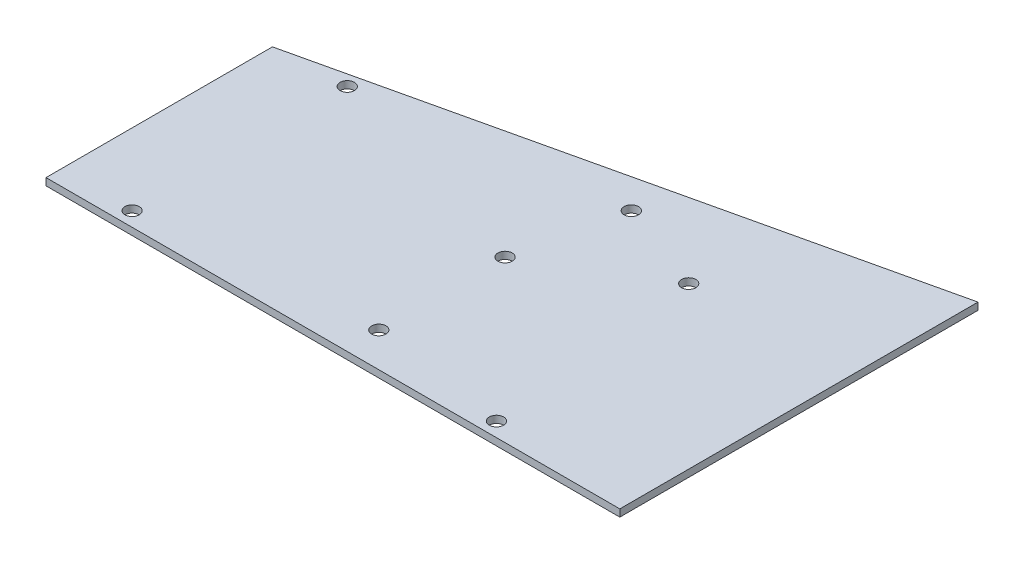
ISO-10303-21;
HEADER;
FILE_DESCRIPTION(('STEP AP214'),'2;1');
FILE_NAME('part.step','',(''),(''),'','','');
FILE_SCHEMA(('AUTOMOTIVE_DESIGN { 1 0 10303 214 1 1 1 1 }'));
ENDSEC;
DATA;
#1=APPLICATION_CONTEXT('core data for automotive mechanical design processes');
#2=APPLICATION_PROTOCOL_DEFINITION('international standard','automotive_design',2000,#1);
#3=PRODUCT_CONTEXT('',#1,'mechanical');
#4=PRODUCT('Part','Part','',(#3));
#5=PRODUCT_RELATED_PRODUCT_CATEGORY('part','',(#4));
#6=PRODUCT_DEFINITION_FORMATION('','',#4);
#7=PRODUCT_DEFINITION_CONTEXT('part definition',#1,'design');
#8=PRODUCT_DEFINITION('design','',#6,#7);
#9=PRODUCT_DEFINITION_SHAPE('','',#8);
#10=(LENGTH_UNIT() NAMED_UNIT(*) SI_UNIT(.MILLI.,.METRE.));
#11=(NAMED_UNIT(*) PLANE_ANGLE_UNIT() SI_UNIT($,.RADIAN.));
#12=(NAMED_UNIT(*) SI_UNIT($,.STERADIAN.) SOLID_ANGLE_UNIT());
#13=UNCERTAINTY_MEASURE_WITH_UNIT(LENGTH_MEASURE(1.E-05),#10,'distance_accuracy_value','');
#14=(GEOMETRIC_REPRESENTATION_CONTEXT(3) GLOBAL_UNCERTAINTY_ASSIGNED_CONTEXT((#13)) GLOBAL_UNIT_ASSIGNED_CONTEXT((#10,
#11,#12)) REPRESENTATION_CONTEXT('',''));
#15=CARTESIAN_POINT('',(0.,0.,0.));
#16=DIRECTION('',(0.,0.,1.));
#17=DIRECTION('',(1.,0.,0.));
#18=AXIS2_PLACEMENT_3D('',#15,#16,#17);
#19=CARTESIAN_POINT('',(92.8885720800182,1.5875,-68.5637805282548));
#20=DIRECTION('',(0.223777407856269,0.,0.97464027811964));
#21=DIRECTION('',(0.97464027811964,0.,-0.223777407856269));
#22=AXIS2_PLACEMENT_3D('',#19,#20,#21);
#23=PLANE('',#22);
#24=DIRECTION('',(-0.97464027811964,0.,0.223777407856269));
#25=VECTOR('',#24,1.);
#26=CARTESIAN_POINT('',(92.8885720800182,0.,-68.5637805282548));
#27=LINE('',#26,#25);
#28=CARTESIAN_POINT('',(92.8885720800182,0.,-68.5637805282548));
#29=VERTEX_POINT('',#28);
#30=CARTESIAN_POINT('',(-34.1114279199818,0.,-39.4045805282548));
#31=VERTEX_POINT('',#30);
#32=EDGE_CURVE('E96',#29,#31,#27,.T.);
#33=ORIENTED_EDGE('',*,*,#32,.T.);
#34=DIRECTION('',(0.,-1.,0.));
#35=VECTOR('',#34,1.);
#36=CARTESIAN_POINT('',(-34.1114279199818,1.5875,-39.4045805282548));
#37=LINE('',#36,#35);
#38=CARTESIAN_POINT('',(-34.1114279199818,1.5875,-39.4045805282548));
#39=VERTEX_POINT('',#38);
#40=EDGE_CURVE('E11',#39,#31,#37,.T.);
#41=ORIENTED_EDGE('',*,*,#40,.F.);
#42=DIRECTION('',(-0.97464027811964,0.,0.223777407856269));
#43=VECTOR('',#42,1.);
#44=CARTESIAN_POINT('',(92.8885720800182,1.5875,-68.5637805282548));
#45=LINE('',#44,#43);
#46=CARTESIAN_POINT('',(92.8885720800182,1.5875,-68.5637805282548));
#47=VERTEX_POINT('',#46);
#48=EDGE_CURVE('E84',#47,#39,#45,.T.);
#49=ORIENTED_EDGE('',*,*,#48,.F.);
#50=DIRECTION('',(0.,-1.,0.));
#51=VECTOR('',#50,1.);
#52=CARTESIAN_POINT('',(92.8885720800182,1.5875,-68.5637805282548));
#53=LINE('',#52,#51);
#54=EDGE_CURVE('E92',#47,#29,#53,.T.);
#55=ORIENTED_EDGE('',*,*,#54,.T.);
#56=EDGE_LOOP('',(#33,#41,#49,#55));
#57=FACE_BOUND('',#56,.T.);
#58=ADVANCED_FACE('F33',(#57),#23,.F.);
#59=CARTESIAN_POINT('',(-34.1114279199818,1.5875,-39.4045805282548));
#60=DIRECTION('',(1.,0.,0.));
#61=DIRECTION('',(0.,0.,-1.));
#62=AXIS2_PLACEMENT_3D('',#59,#60,#61);
#63=PLANE('',#62);
#64=DIRECTION('',(0.,0.,1.));
#65=VECTOR('',#64,1.);
#66=CARTESIAN_POINT('',(-34.1114279199818,0.,-39.4045805282548));
#67=LINE('',#66,#65);
#68=CARTESIAN_POINT('',(-34.1114279199818,0.,10.7096194717452));
#69=VERTEX_POINT('',#68);
#70=EDGE_CURVE('E88',#31,#69,#67,.T.);
#71=ORIENTED_EDGE('',*,*,#70,.T.);
#72=DIRECTION('',(0.,-1.,0.));
#73=VECTOR('',#72,1.);
#74=CARTESIAN_POINT('',(-34.1114279199818,1.5875,10.7096194717452));
#75=LINE('',#74,#73);
#76=CARTESIAN_POINT('',(-34.1114279199818,1.5875,10.7096194717452));
#77=VERTEX_POINT('',#76);
#78=EDGE_CURVE('E41',#77,#69,#75,.T.);
#79=ORIENTED_EDGE('',*,*,#78,.F.);
#80=DIRECTION('',(0.,0.,1.));
#81=VECTOR('',#80,1.);
#82=CARTESIAN_POINT('',(-34.1114279199818,1.5875,-39.4045805282548));
#83=LINE('',#82,#81);
#84=EDGE_CURVE('E79',#39,#77,#83,.T.);
#85=ORIENTED_EDGE('',*,*,#84,.F.);
#86=ORIENTED_EDGE('',*,*,#40,.T.);
#87=EDGE_LOOP('',(#71,#79,#85,#86));
#88=FACE_BOUND('',#87,.T.);
#89=ADVANCED_FACE('F87',(#88),#63,.F.);
#90=CARTESIAN_POINT('',(-34.1114279199818,1.5875,10.7096194717452));
#91=DIRECTION('',(0.,0.,-1.));
#92=DIRECTION('',(-1.,0.,0.));
#93=AXIS2_PLACEMENT_3D('',#90,#91,#92);
#94=PLANE('',#93);
#95=DIRECTION('',(1.,0.,0.));
#96=VECTOR('',#95,1.);
#97=CARTESIAN_POINT('',(-34.1114279199818,0.,10.7096194717452));
#98=LINE('',#97,#96);
#99=CARTESIAN_POINT('',(92.8885720800182,0.,10.7096194717452));
#100=VERTEX_POINT('',#99);
#101=EDGE_CURVE('E66',#69,#100,#98,.T.);
#102=ORIENTED_EDGE('',*,*,#101,.T.);
#103=DIRECTION('',(0.,-1.,0.));
#104=VECTOR('',#103,1.);
#105=CARTESIAN_POINT('',(92.8885720800182,1.5875,10.7096194717452));
#106=LINE('',#105,#104);
#107=CARTESIAN_POINT('',(92.8885720800182,1.5875,10.7096194717452));
#108=VERTEX_POINT('',#107);
#109=EDGE_CURVE('E89',#108,#100,#106,.T.);
#110=ORIENTED_EDGE('',*,*,#109,.F.);
#111=DIRECTION('',(1.,0.,0.));
#112=VECTOR('',#111,1.);
#113=CARTESIAN_POINT('',(-34.1114279199818,1.5875,10.7096194717452));
#114=LINE('',#113,#112);
#115=EDGE_CURVE('E82',#77,#108,#114,.T.);
#116=ORIENTED_EDGE('',*,*,#115,.F.);
#117=ORIENTED_EDGE('',*,*,#78,.T.);
#118=EDGE_LOOP('',(#102,#110,#116,#117));
#119=FACE_BOUND('',#118,.T.);
#120=ADVANCED_FACE('F90',(#119),#94,.F.);
#121=CARTESIAN_POINT('',(92.8885720800182,1.5875,10.7096194717452));
#122=DIRECTION('',(-1.,0.,0.));
#123=DIRECTION('',(0.,0.,1.));
#124=AXIS2_PLACEMENT_3D('',#121,#122,#123);
#125=PLANE('',#124);
#126=DIRECTION('',(0.,0.,-1.));
#127=VECTOR('',#126,1.);
#128=CARTESIAN_POINT('',(92.8885720800182,0.,10.7096194717452));
#129=LINE('',#128,#127);
#130=EDGE_CURVE('E72',#100,#29,#129,.T.);
#131=ORIENTED_EDGE('',*,*,#130,.T.);
#132=ORIENTED_EDGE('',*,*,#54,.F.);
#133=DIRECTION('',(0.,0.,-1.));
#134=VECTOR('',#133,1.);
#135=CARTESIAN_POINT('',(92.8885720800182,1.5875,10.7096194717452));
#136=LINE('',#135,#134);
#137=EDGE_CURVE('E49',#108,#47,#136,.T.);
#138=ORIENTED_EDGE('',*,*,#137,.F.);
#139=ORIENTED_EDGE('',*,*,#109,.T.);
#140=EDGE_LOOP('',(#131,#132,#138,#139));
#141=FACE_BOUND('',#140,.T.);
#142=ADVANCED_FACE('F104',(#141),#125,.F.);
#143=CARTESIAN_POINT('',(0.,1.5875,0.));
#144=DIRECTION('',(0.,1.,0.));
#145=DIRECTION('',(0.,0.,1.));
#146=AXIS2_PLACEMENT_3D('',#143,#144,#145);
#147=PLANE('',#146);
#148=CARTESIAN_POINT('',(62.4085720800182,1.5875,7.5346194717452));
#149=DIRECTION('',(0.,1.,0.));
#150=DIRECTION('',(0.,0.,1.));
#151=AXIS2_PLACEMENT_3D('',#148,#149,#150);
#152=CIRCLE('',#151,1.5875);
#153=CARTESIAN_POINT('',(62.4085720800182,1.5875,9.1221194717452));
#154=VERTEX_POINT('',#153);
#155=EDGE_CURVE('E146',#154,#154,#152,.T.);
#156=ORIENTED_EDGE('',*,*,#155,.F.);
#157=EDGE_LOOP('',(#156));
#158=FACE_BOUND('',#157,.T.);
#159=CARTESIAN_POINT('',(57.3285720800182,1.5875,-40.0903805282548));
#160=DIRECTION('',(0.,1.,0.));
#161=DIRECTION('',(0.,0.,1.));
#162=AXIS2_PLACEMENT_3D('',#159,#160,#161);
#163=CIRCLE('',#162,1.5875);
#164=CARTESIAN_POINT('',(57.3285720800182,1.5875,-38.5028805282548));
#165=VERTEX_POINT('',#164);
#166=EDGE_CURVE('E140',#165,#165,#163,.T.);
#167=ORIENTED_EDGE('',*,*,#166,.F.);
#168=EDGE_LOOP('',(#167));
#169=FACE_BOUND('',#168,.T.);
#170=CARTESIAN_POINT('',(31.9285720800182,1.5875,-24.8503805282548));
#171=DIRECTION('',(0.,1.,0.));
#172=DIRECTION('',(0.,0.,1.));
#173=AXIS2_PLACEMENT_3D('',#170,#171,#172);
#174=CIRCLE('',#173,1.5875);
#175=CARTESIAN_POINT('',(31.9285720800182,1.5875,-23.2628805282548));
#176=VERTEX_POINT('',#175);
#177=EDGE_CURVE('E134',#176,#176,#174,.T.);
#178=ORIENTED_EDGE('',*,*,#177,.F.);
#179=EDGE_LOOP('',(#178));
#180=FACE_BOUND('',#179,.T.);
#181=CARTESIAN_POINT('',(31.9285720800182,1.5875,3.0896194717452));
#182=DIRECTION('',(0.,1.,0.));
#183=DIRECTION('',(0.,0.,1.));
#184=AXIS2_PLACEMENT_3D('',#181,#182,#183);
#185=CIRCLE('',#184,1.5875);
#186=CARTESIAN_POINT('',(31.9285720800182,1.5875,4.6771194717452));
#187=VERTEX_POINT('',#186);
#188=EDGE_CURVE('E128',#187,#187,#185,.T.);
#189=ORIENTED_EDGE('',*,*,#188,.F.);
#190=EDGE_LOOP('',(#189));
#191=FACE_BOUND('',#190,.T.);
#192=CARTESIAN_POINT('',(37.0085720800182,1.5875,-47.7103805282548));
#193=DIRECTION('',(0.,1.,0.));
#194=DIRECTION('',(0.,0.,1.));
#195=AXIS2_PLACEMENT_3D('',#192,#193,#194);
#196=CIRCLE('',#195,1.5875);
#197=CARTESIAN_POINT('',(37.0085720800182,1.5875,-46.1228805282548));
#198=VERTEX_POINT('',#197);
#199=EDGE_CURVE('E122',#198,#198,#196,.T.);
#200=ORIENTED_EDGE('',*,*,#199,.F.);
#201=EDGE_LOOP('',(#200));
#202=FACE_BOUND('',#201,.T.);
#203=CARTESIAN_POINT('',(-18.2364279199818,1.5875,7.5346194717452));
#204=DIRECTION('',(0.,1.,0.));
#205=DIRECTION('',(0.,0.,1.));
#206=AXIS2_PLACEMENT_3D('',#203,#204,#205);
#207=CIRCLE('',#206,1.5875);
#208=CARTESIAN_POINT('',(-18.2364279199818,1.5875,9.1221194717452));
#209=VERTEX_POINT('',#208);
#210=EDGE_CURVE('E116',#209,#209,#207,.T.);
#211=ORIENTED_EDGE('',*,*,#210,.F.);
#212=EDGE_LOOP('',(#211));
#213=FACE_BOUND('',#212,.T.);
#214=CARTESIAN_POINT('',(-18.2364279199818,1.5875,-40.0903805282548));
#215=DIRECTION('',(0.,1.,0.));
#216=DIRECTION('',(0.,0.,1.));
#217=AXIS2_PLACEMENT_3D('',#214,#215,#216);
#218=CIRCLE('',#217,1.5875);
#219=CARTESIAN_POINT('',(-18.2364279199818,1.5875,-38.5028805282548));
#220=VERTEX_POINT('',#219);
#221=EDGE_CURVE('E110',#220,#220,#218,.T.);
#222=ORIENTED_EDGE('',*,*,#221,.F.);
#223=EDGE_LOOP('',(#222));
#224=FACE_BOUND('',#223,.T.);
#225=ORIENTED_EDGE('',*,*,#48,.T.);
#226=ORIENTED_EDGE('',*,*,#84,.T.);
#227=ORIENTED_EDGE('',*,*,#115,.T.);
#228=ORIENTED_EDGE('',*,*,#137,.T.);
#229=EDGE_LOOP('',(#225,#226,#227,#228));
#230=FACE_BOUND('',#229,.T.);
#231=ADVANCED_FACE('F80',(#158,#169,#180,#191,#202,#213,#224,#230),#147,.T.);
#232=CARTESIAN_POINT('',(0.,0.,0.));
#233=DIRECTION('',(0.,1.,0.));
#234=DIRECTION('',(0.,0.,1.));
#235=AXIS2_PLACEMENT_3D('',#232,#233,#234);
#236=PLANE('',#235);
#237=CARTESIAN_POINT('',(62.4085720800182,0.,7.5346194717452));
#238=DIRECTION('',(0.,1.,0.));
#239=DIRECTION('',(0.,0.,1.));
#240=AXIS2_PLACEMENT_3D('',#237,#238,#239);
#241=CIRCLE('',#240,1.5875);
#242=CARTESIAN_POINT('',(62.4085720800182,0.,9.1221194717452));
#243=VERTEX_POINT('',#242);
#244=EDGE_CURVE('E143',#243,#243,#241,.T.);
#245=ORIENTED_EDGE('',*,*,#244,.T.);
#246=EDGE_LOOP('',(#245));
#247=FACE_BOUND('',#246,.T.);
#248=CARTESIAN_POINT('',(57.3285720800182,0.,-40.0903805282548));
#249=DIRECTION('',(0.,1.,0.));
#250=DIRECTION('',(0.,0.,1.));
#251=AXIS2_PLACEMENT_3D('',#248,#249,#250);
#252=CIRCLE('',#251,1.5875);
#253=CARTESIAN_POINT('',(57.3285720800182,0.,-38.5028805282548));
#254=VERTEX_POINT('',#253);
#255=EDGE_CURVE('E137',#254,#254,#252,.T.);
#256=ORIENTED_EDGE('',*,*,#255,.T.);
#257=EDGE_LOOP('',(#256));
#258=FACE_BOUND('',#257,.T.);
#259=CARTESIAN_POINT('',(31.9285720800182,0.,-24.8503805282548));
#260=DIRECTION('',(0.,1.,0.));
#261=DIRECTION('',(0.,0.,1.));
#262=AXIS2_PLACEMENT_3D('',#259,#260,#261);
#263=CIRCLE('',#262,1.5875);
#264=CARTESIAN_POINT('',(31.9285720800182,0.,-23.2628805282548));
#265=VERTEX_POINT('',#264);
#266=EDGE_CURVE('E131',#265,#265,#263,.T.);
#267=ORIENTED_EDGE('',*,*,#266,.T.);
#268=EDGE_LOOP('',(#267));
#269=FACE_BOUND('',#268,.T.);
#270=CARTESIAN_POINT('',(31.9285720800182,0.,3.0896194717452));
#271=DIRECTION('',(0.,1.,0.));
#272=DIRECTION('',(0.,0.,1.));
#273=AXIS2_PLACEMENT_3D('',#270,#271,#272);
#274=CIRCLE('',#273,1.5875);
#275=CARTESIAN_POINT('',(31.9285720800182,0.,4.6771194717452));
#276=VERTEX_POINT('',#275);
#277=EDGE_CURVE('E125',#276,#276,#274,.T.);
#278=ORIENTED_EDGE('',*,*,#277,.T.);
#279=EDGE_LOOP('',(#278));
#280=FACE_BOUND('',#279,.T.);
#281=CARTESIAN_POINT('',(37.0085720800182,0.,-47.7103805282548));
#282=DIRECTION('',(0.,1.,0.));
#283=DIRECTION('',(0.,0.,1.));
#284=AXIS2_PLACEMENT_3D('',#281,#282,#283);
#285=CIRCLE('',#284,1.5875);
#286=CARTESIAN_POINT('',(37.0085720800182,0.,-46.1228805282548));
#287=VERTEX_POINT('',#286);
#288=EDGE_CURVE('E119',#287,#287,#285,.T.);
#289=ORIENTED_EDGE('',*,*,#288,.T.);
#290=EDGE_LOOP('',(#289));
#291=FACE_BOUND('',#290,.T.);
#292=CARTESIAN_POINT('',(-18.2364279199818,0.,7.5346194717452));
#293=DIRECTION('',(0.,1.,0.));
#294=DIRECTION('',(0.,0.,1.));
#295=AXIS2_PLACEMENT_3D('',#292,#293,#294);
#296=CIRCLE('',#295,1.5875);
#297=CARTESIAN_POINT('',(-18.2364279199818,0.,9.1221194717452));
#298=VERTEX_POINT('',#297);
#299=EDGE_CURVE('E113',#298,#298,#296,.T.);
#300=ORIENTED_EDGE('',*,*,#299,.T.);
#301=EDGE_LOOP('',(#300));
#302=FACE_BOUND('',#301,.T.);
#303=CARTESIAN_POINT('',(-18.2364279199818,0.,-40.0903805282548));
#304=DIRECTION('',(0.,1.,0.));
#305=DIRECTION('',(0.,0.,1.));
#306=AXIS2_PLACEMENT_3D('',#303,#304,#305);
#307=CIRCLE('',#306,1.5875);
#308=CARTESIAN_POINT('',(-18.2364279199818,0.,-38.5028805282548));
#309=VERTEX_POINT('',#308);
#310=EDGE_CURVE('E99',#309,#309,#307,.T.);
#311=ORIENTED_EDGE('',*,*,#310,.T.);
#312=EDGE_LOOP('',(#311));
#313=FACE_BOUND('',#312,.T.);
#314=ORIENTED_EDGE('',*,*,#32,.F.);
#315=ORIENTED_EDGE('',*,*,#130,.F.);
#316=ORIENTED_EDGE('',*,*,#101,.F.);
#317=ORIENTED_EDGE('',*,*,#70,.F.);
#318=EDGE_LOOP('',(#314,#315,#316,#317));
#319=FACE_BOUND('',#318,.T.);
#320=ADVANCED_FACE('F107',(#247,#258,#269,#280,#291,#302,#313,#319),#236,.F.);
#321=CARTESIAN_POINT('',(-18.2364279199818,0.,-40.0903805282548));
#322=DIRECTION('',(0.,1.,0.));
#323=DIRECTION('',(0.,0.,1.));
#324=AXIS2_PLACEMENT_3D('',#321,#322,#323);
#325=CYLINDRICAL_SURFACE('',#324,1.5875);
#326=ORIENTED_EDGE('',*,*,#310,.F.);
#327=EDGE_LOOP('',(#326));
#328=FACE_BOUND('',#327,.T.);
#329=ORIENTED_EDGE('',*,*,#221,.T.);
#330=EDGE_LOOP('',(#329));
#331=FACE_BOUND('',#330,.T.);
#332=ADVANCED_FACE('F176',(#328,#331),#325,.F.);
#333=CARTESIAN_POINT('',(-18.2364279199818,0.,7.5346194717452));
#334=DIRECTION('',(0.,1.,0.));
#335=DIRECTION('',(0.,0.,1.));
#336=AXIS2_PLACEMENT_3D('',#333,#334,#335);
#337=CYLINDRICAL_SURFACE('',#336,1.5875);
#338=ORIENTED_EDGE('',*,*,#299,.F.);
#339=EDGE_LOOP('',(#338));
#340=FACE_BOUND('',#339,.T.);
#341=ORIENTED_EDGE('',*,*,#210,.T.);
#342=EDGE_LOOP('',(#341));
#343=FACE_BOUND('',#342,.T.);
#344=ADVANCED_FACE('F178',(#340,#343),#337,.F.);
#345=CARTESIAN_POINT('',(37.0085720800182,0.,-47.7103805282548));
#346=DIRECTION('',(0.,1.,0.));
#347=DIRECTION('',(0.,0.,1.));
#348=AXIS2_PLACEMENT_3D('',#345,#346,#347);
#349=CYLINDRICAL_SURFACE('',#348,1.5875);
#350=ORIENTED_EDGE('',*,*,#288,.F.);
#351=EDGE_LOOP('',(#350));
#352=FACE_BOUND('',#351,.T.);
#353=ORIENTED_EDGE('',*,*,#199,.T.);
#354=EDGE_LOOP('',(#353));
#355=FACE_BOUND('',#354,.T.);
#356=ADVANCED_FACE('F185',(#352,#355),#349,.F.);
#357=CARTESIAN_POINT('',(31.9285720800182,0.,3.0896194717452));
#358=DIRECTION('',(0.,1.,0.));
#359=DIRECTION('',(0.,0.,1.));
#360=AXIS2_PLACEMENT_3D('',#357,#358,#359);
#361=CYLINDRICAL_SURFACE('',#360,1.5875);
#362=ORIENTED_EDGE('',*,*,#277,.F.);
#363=EDGE_LOOP('',(#362));
#364=FACE_BOUND('',#363,.T.);
#365=ORIENTED_EDGE('',*,*,#188,.T.);
#366=EDGE_LOOP('',(#365));
#367=FACE_BOUND('',#366,.T.);
#368=ADVANCED_FACE('F233',(#364,#367),#361,.F.);
#369=CARTESIAN_POINT('',(31.9285720800182,0.,-24.8503805282548));
#370=DIRECTION('',(0.,1.,0.));
#371=DIRECTION('',(0.,0.,1.));
#372=AXIS2_PLACEMENT_3D('',#369,#370,#371);
#373=CYLINDRICAL_SURFACE('',#372,1.5875);
#374=ORIENTED_EDGE('',*,*,#266,.F.);
#375=EDGE_LOOP('',(#374));
#376=FACE_BOUND('',#375,.T.);
#377=ORIENTED_EDGE('',*,*,#177,.T.);
#378=EDGE_LOOP('',(#377));
#379=FACE_BOUND('',#378,.T.);
#380=ADVANCED_FACE('F243',(#376,#379),#373,.F.);
#381=CARTESIAN_POINT('',(57.3285720800182,0.,-40.0903805282548));
#382=DIRECTION('',(0.,1.,0.));
#383=DIRECTION('',(0.,0.,1.));
#384=AXIS2_PLACEMENT_3D('',#381,#382,#383);
#385=CYLINDRICAL_SURFACE('',#384,1.5875);
#386=ORIENTED_EDGE('',*,*,#255,.F.);
#387=EDGE_LOOP('',(#386));
#388=FACE_BOUND('',#387,.T.);
#389=ORIENTED_EDGE('',*,*,#166,.T.);
#390=EDGE_LOOP('',(#389));
#391=FACE_BOUND('',#390,.T.);
#392=ADVANCED_FACE('F157',(#388,#391),#385,.F.);
#393=CARTESIAN_POINT('',(62.4085720800182,0.,7.5346194717452));
#394=DIRECTION('',(0.,1.,0.));
#395=DIRECTION('',(0.,0.,1.));
#396=AXIS2_PLACEMENT_3D('',#393,#394,#395);
#397=CYLINDRICAL_SURFACE('',#396,1.5875);
#398=ORIENTED_EDGE('',*,*,#244,.F.);
#399=EDGE_LOOP('',(#398));
#400=FACE_BOUND('',#399,.T.);
#401=ORIENTED_EDGE('',*,*,#155,.T.);
#402=EDGE_LOOP('',(#401));
#403=FACE_BOUND('',#402,.T.);
#404=ADVANCED_FACE('F154',(#400,#403),#397,.F.);
#405=CLOSED_SHELL('',(#58,#89,#120,#142,#231,#320,#332,#344,#356,#368,#380,#392,#404));
#406=MANIFOLD_SOLID_BREP('B2',#405);
#407=ADVANCED_BREP_SHAPE_REPRESENTATION('',(#18,#406),#14);
#408=SHAPE_DEFINITION_REPRESENTATION(#9,#407);
ENDSEC;
END-ISO-10303-21;
